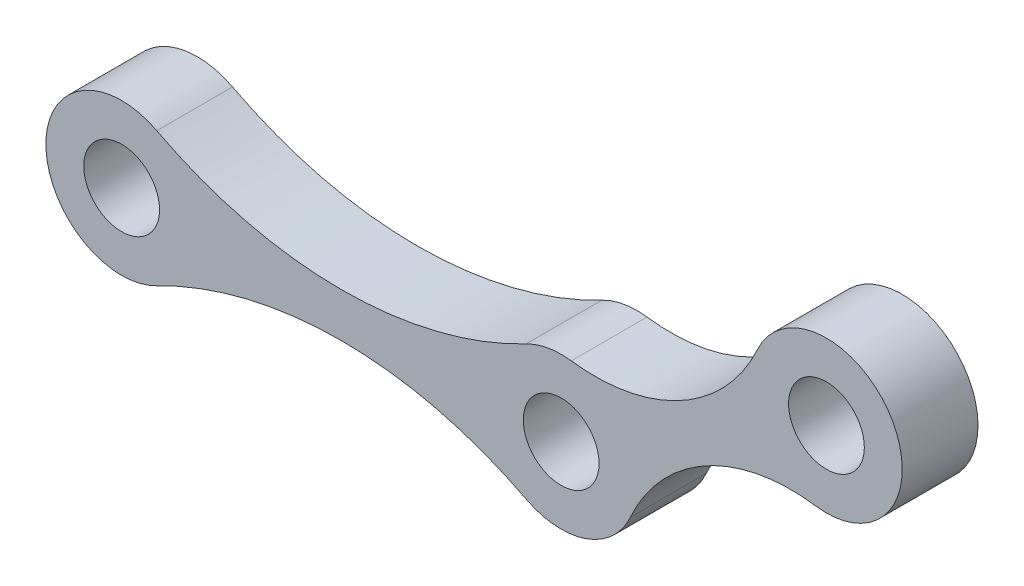
ISO-10303-21;
HEADER;
FILE_DESCRIPTION(('STEP AP214'),'2;1');
FILE_NAME('part.step','',(''),(''),'','','');
FILE_SCHEMA(('AUTOMOTIVE_DESIGN { 1 0 10303 214 1 1 1 1 }'));
ENDSEC;
DATA;
#1=APPLICATION_CONTEXT('core data for automotive mechanical design processes');
#2=APPLICATION_PROTOCOL_DEFINITION('international standard','automotive_design',2000,#1);
#3=PRODUCT_CONTEXT('',#1,'mechanical');
#4=PRODUCT('Part','Part','',(#3));
#5=PRODUCT_RELATED_PRODUCT_CATEGORY('part','',(#4));
#6=PRODUCT_DEFINITION_FORMATION('','',#4);
#7=PRODUCT_DEFINITION_CONTEXT('part definition',#1,'design');
#8=PRODUCT_DEFINITION('design','',#6,#7);
#9=PRODUCT_DEFINITION_SHAPE('','',#8);
#10=(LENGTH_UNIT() NAMED_UNIT(*) SI_UNIT(.MILLI.,.METRE.));
#11=(NAMED_UNIT(*) PLANE_ANGLE_UNIT() SI_UNIT($,.RADIAN.));
#12=(NAMED_UNIT(*) SI_UNIT($,.STERADIAN.) SOLID_ANGLE_UNIT());
#13=UNCERTAINTY_MEASURE_WITH_UNIT(LENGTH_MEASURE(1.E-05),#10,'distance_accuracy_value','');
#14=(GEOMETRIC_REPRESENTATION_CONTEXT(3) GLOBAL_UNCERTAINTY_ASSIGNED_CONTEXT((#13)) GLOBAL_UNIT_ASSIGNED_CONTEXT((#10,
#11,#12)) REPRESENTATION_CONTEXT('',''));
#15=CARTESIAN_POINT('',(0.,0.,0.));
#16=DIRECTION('',(0.,0.,1.));
#17=DIRECTION('',(1.,0.,0.));
#18=AXIS2_PLACEMENT_3D('',#15,#16,#17);
#19=CARTESIAN_POINT('',(46.5043103448276,9.67466378495718,2.5));
#20=DIRECTION('',(0.,0.,1.));
#21=DIRECTION('',(1.,0.,0.));
#22=AXIS2_PLACEMENT_3D('',#19,#20,#21);
#23=PLANE('',#22);
#24=CARTESIAN_POINT('',(29.,0.,2.5));
#25=DIRECTION('',(0.,0.,1.));
#26=DIRECTION('',(1.,0.,0.));
#27=AXIS2_PLACEMENT_3D('',#24,#25,#26);
#28=CIRCLE('',#27,2.5);
#29=CARTESIAN_POINT('',(31.5,0.,2.5));
#30=VERTEX_POINT('',#29);
#31=EDGE_CURVE('E166',#30,#30,#28,.T.);
#32=ORIENTED_EDGE('',*,*,#31,.F.);
#33=EDGE_LOOP('',(#32));
#34=FACE_BOUND('',#33,.T.);
#35=CARTESIAN_POINT('',(46.5043103448276,9.67466378495718,2.5));
#36=DIRECTION('',(0.,0.,1.));
#37=DIRECTION('',(1.,0.,0.));
#38=AXIS2_PLACEMENT_3D('',#35,#36,#37);
#39=CIRCLE('',#38,2.5);
#40=CARTESIAN_POINT('',(49.0043103448276,9.67466378495718,2.5));
#41=VERTEX_POINT('',#40);
#42=EDGE_CURVE('E106',#41,#41,#39,.T.);
#43=ORIENTED_EDGE('',*,*,#42,.F.);
#44=EDGE_LOOP('',(#43));
#45=FACE_BOUND('',#44,.T.);
#46=CARTESIAN_POINT('',(0.,0.,2.5));
#47=DIRECTION('',(0.,0.,1.));
#48=DIRECTION('',(1.,0.,0.));
#49=AXIS2_PLACEMENT_3D('',#46,#47,#48);
#50=CIRCLE('',#49,2.5);
#51=CARTESIAN_POINT('',(2.5,0.,2.5));
#52=VERTEX_POINT('',#51);
#53=EDGE_CURVE('E160',#52,#52,#50,.T.);
#54=ORIENTED_EDGE('',*,*,#53,.F.);
#55=EDGE_LOOP('',(#54));
#56=FACE_BOUND('',#55,.T.);
#57=CARTESIAN_POINT('',(14.5,-28.0695342802877,2.5));
#58=DIRECTION('',(0.,0.,-1.));
#59=DIRECTION('',(1.,0.,0.));
#60=AXIS2_PLACEMENT_3D('',#57,#58,#59);
#61=CIRCLE('',#60,26.593492284207);
#62=CARTESIAN_POINT('',(2.2947763845734,-4.44229685464674,2.5));
#63=VERTEX_POINT('',#62);
#64=CARTESIAN_POINT('',(26.7052236154266,-4.44229685464674,2.5));
#65=VERTEX_POINT('',#64);
#66=EDGE_CURVE('E119',#63,#65,#61,.T.);
#67=ORIENTED_EDGE('',*,*,#66,.T.);
#68=CARTESIAN_POINT('',(29.,0.,2.5));
#69=DIRECTION('',(0.,0.,1.));
#70=DIRECTION('',(1.,0.,0.));
#71=AXIS2_PLACEMENT_3D('',#68,#69,#70);
#72=CIRCLE('',#71,5.);
#73=CARTESIAN_POINT('',(33.5688991211203,-2.03104919217295,2.5));
#74=VERTEX_POINT('',#73);
#75=EDGE_CURVE('E12',#65,#74,#72,.T.);
#76=ORIENTED_EDGE('',*,*,#75,.T.);
#77=CARTESIAN_POINT('',(44.1474358599628,-6.73361055941316,2.5));
#78=DIRECTION('',(0.,0.,-1.));
#79=DIRECTION('',(1.,0.,0.));
#80=AXIS2_PLACEMENT_3D('',#77,#78,#79);
#81=CIRCLE('',#80,11.5766801349826);
#82=CARTESIAN_POINT('',(45.7934097104204,4.72545977946301,2.5));
#83=VERTEX_POINT('',#82);
#84=EDGE_CURVE('E134',#74,#83,#81,.T.);
#85=ORIENTED_EDGE('',*,*,#84,.T.);
#86=CARTESIAN_POINT('',(46.5043103448276,9.67466378495718,2.5));
#87=DIRECTION('',(0.,0.,1.));
#88=DIRECTION('',(1.,0.,0.));
#89=AXIS2_PLACEMENT_3D('',#86,#87,#88);
#90=CIRCLE('',#89,5.00000000000001);
#91=CARTESIAN_POINT('',(41.9532372313997,11.7453480960568,2.5));
#92=VERTEX_POINT('',#91);
#93=EDGE_CURVE('E56',#83,#92,#90,.T.);
#94=ORIENTED_EDGE('',*,*,#93,.T.);
#95=CARTESIAN_POINT('',(31.2399930695595,16.6197471782095,2.5));
#96=DIRECTION('',(0.,0.,-1.));
#97=DIRECTION('',(-1.,0.,0.));
#98=AXIS2_PLACEMENT_3D('',#95,#96,#97);
#99=CIRCLE('',#98,11.7700198335982);
#100=CARTESIAN_POINT('',(29.6678564163269,4.95519604124509,2.5));
#101=VERTEX_POINT('',#100);
#102=EDGE_CURVE('E136',#92,#101,#99,.T.);
#103=ORIENTED_EDGE('',*,*,#102,.T.);
#104=CARTESIAN_POINT('',(29.,0.,2.5));
#105=DIRECTION('',(0.,0.,1.));
#106=DIRECTION('',(1.,0.,0.));
#107=AXIS2_PLACEMENT_3D('',#104,#105,#106);
#108=CIRCLE('',#107,5.);
#109=CARTESIAN_POINT('',(26.6829189594039,4.43070371964886,2.5));
#110=VERTEX_POINT('',#109);
#111=EDGE_CURVE('E139',#101,#110,#108,.T.);
#112=ORIENTED_EDGE('',*,*,#111,.T.);
#113=CARTESIAN_POINT('',(14.5,27.7267833145711,2.5));
#114=DIRECTION('',(0.,0.,-1.));
#115=DIRECTION('',(-1.,0.,0.));
#116=AXIS2_PLACEMENT_3D('',#113,#114,#115);
#117=CIRCLE('',#116,26.2893674108822);
#118=CARTESIAN_POINT('',(2.31708104059608,4.43070371964886,2.5));
#119=VERTEX_POINT('',#118);
#120=EDGE_CURVE('E124',#110,#119,#117,.T.);
#121=ORIENTED_EDGE('',*,*,#120,.T.);
#122=CARTESIAN_POINT('',(0.,0.,2.5));
#123=DIRECTION('',(0.,0.,1.));
#124=DIRECTION('',(1.,0.,0.));
#125=AXIS2_PLACEMENT_3D('',#122,#123,#124);
#126=CIRCLE('',#125,5.);
#127=EDGE_CURVE('E43',#119,#63,#126,.T.);
#128=ORIENTED_EDGE('',*,*,#127,.T.);
#129=EDGE_LOOP('',(#67,#76,#85,#94,#103,#112,#121,#128));
#130=FACE_BOUND('',#129,.T.);
#131=ADVANCED_FACE('F34',(#34,#45,#56,#130),#23,.T.);
#132=CARTESIAN_POINT('',(46.5043103448276,9.67466378495718,-2.5));
#133=DIRECTION('',(0.,0.,1.));
#134=DIRECTION('',(1.,0.,0.));
#135=AXIS2_PLACEMENT_3D('',#132,#133,#134);
#136=PLANE('',#135);
#137=CARTESIAN_POINT('',(0.,0.,-2.5));
#138=DIRECTION('',(0.,0.,1.));
#139=DIRECTION('',(1.,0.,0.));
#140=AXIS2_PLACEMENT_3D('',#137,#138,#139);
#141=CIRCLE('',#140,2.5);
#142=CARTESIAN_POINT('',(2.5,0.,-2.5));
#143=VERTEX_POINT('',#142);
#144=EDGE_CURVE('E145',#143,#143,#141,.T.);
#145=ORIENTED_EDGE('',*,*,#144,.T.);
#146=EDGE_LOOP('',(#145));
#147=FACE_BOUND('',#146,.T.);
#148=CARTESIAN_POINT('',(29.,0.,-2.5));
#149=DIRECTION('',(0.,0.,1.));
#150=DIRECTION('',(1.,0.,0.));
#151=AXIS2_PLACEMENT_3D('',#148,#149,#150);
#152=CIRCLE('',#151,2.5);
#153=CARTESIAN_POINT('',(31.5,0.,-2.5));
#154=VERTEX_POINT('',#153);
#155=EDGE_CURVE('E163',#154,#154,#152,.T.);
#156=ORIENTED_EDGE('',*,*,#155,.T.);
#157=EDGE_LOOP('',(#156));
#158=FACE_BOUND('',#157,.T.);
#159=CARTESIAN_POINT('',(46.5043103448276,9.67466378495718,-2.5));
#160=DIRECTION('',(0.,0.,1.));
#161=DIRECTION('',(1.,0.,0.));
#162=AXIS2_PLACEMENT_3D('',#159,#160,#161);
#163=CIRCLE('',#162,2.5);
#164=CARTESIAN_POINT('',(49.0043103448276,9.67466378495718,-2.5));
#165=VERTEX_POINT('',#164);
#166=EDGE_CURVE('E169',#165,#165,#163,.T.);
#167=ORIENTED_EDGE('',*,*,#166,.T.);
#168=EDGE_LOOP('',(#167));
#169=FACE_BOUND('',#168,.T.);
#170=CARTESIAN_POINT('',(29.,0.,-2.5));
#171=DIRECTION('',(0.,0.,1.));
#172=DIRECTION('',(1.,0.,0.));
#173=AXIS2_PLACEMENT_3D('',#170,#171,#172);
#174=CIRCLE('',#173,5.);
#175=CARTESIAN_POINT('',(26.7052236154266,-4.44229685464674,-2.5));
#176=VERTEX_POINT('',#175);
#177=CARTESIAN_POINT('',(33.5688991211203,-2.03104919217295,-2.5));
#178=VERTEX_POINT('',#177);
#179=EDGE_CURVE('E38',#176,#178,#174,.T.);
#180=ORIENTED_EDGE('',*,*,#179,.F.);
#181=CARTESIAN_POINT('',(14.5,-28.0695342802877,-2.5));
#182=DIRECTION('',(0.,0.,-1.));
#183=DIRECTION('',(1.,0.,0.));
#184=AXIS2_PLACEMENT_3D('',#181,#182,#183);
#185=CIRCLE('',#184,26.593492284207);
#186=CARTESIAN_POINT('',(2.2947763845734,-4.44229685464674,-2.5));
#187=VERTEX_POINT('',#186);
#188=EDGE_CURVE('E113',#187,#176,#185,.T.);
#189=ORIENTED_EDGE('',*,*,#188,.F.);
#190=CARTESIAN_POINT('',(0.,0.,-2.5));
#191=DIRECTION('',(0.,0.,1.));
#192=DIRECTION('',(1.,0.,0.));
#193=AXIS2_PLACEMENT_3D('',#190,#191,#192);
#194=CIRCLE('',#193,5.);
#195=CARTESIAN_POINT('',(2.31708104059608,4.43070371964886,-2.5));
#196=VERTEX_POINT('',#195);
#197=EDGE_CURVE('E105',#196,#187,#194,.T.);
#198=ORIENTED_EDGE('',*,*,#197,.F.);
#199=CARTESIAN_POINT('',(14.5,27.7267833145711,-2.5));
#200=DIRECTION('',(0.,0.,-1.));
#201=DIRECTION('',(-1.,0.,0.));
#202=AXIS2_PLACEMENT_3D('',#199,#200,#201);
#203=CIRCLE('',#202,26.2893674108822);
#204=CARTESIAN_POINT('',(26.6829189594039,4.43070371964886,-2.5));
#205=VERTEX_POINT('',#204);
#206=EDGE_CURVE('E129',#205,#196,#203,.T.);
#207=ORIENTED_EDGE('',*,*,#206,.F.);
#208=CARTESIAN_POINT('',(29.,0.,-2.5));
#209=DIRECTION('',(0.,0.,1.));
#210=DIRECTION('',(1.,0.,0.));
#211=AXIS2_PLACEMENT_3D('',#208,#209,#210);
#212=CIRCLE('',#211,5.);
#213=CARTESIAN_POINT('',(29.6678564163269,4.95519604124509,-2.5));
#214=VERTEX_POINT('',#213);
#215=EDGE_CURVE('E121',#214,#205,#212,.T.);
#216=ORIENTED_EDGE('',*,*,#215,.F.);
#217=CARTESIAN_POINT('',(31.2399930695595,16.6197471782095,-2.5));
#218=DIRECTION('',(0.,0.,-1.));
#219=DIRECTION('',(-1.,0.,0.));
#220=AXIS2_PLACEMENT_3D('',#217,#218,#219);
#221=CIRCLE('',#220,11.7700198335982);
#222=CARTESIAN_POINT('',(41.9532372313997,11.7453480960568,-2.5));
#223=VERTEX_POINT('',#222);
#224=EDGE_CURVE('E104',#223,#214,#221,.T.);
#225=ORIENTED_EDGE('',*,*,#224,.F.);
#226=CARTESIAN_POINT('',(46.5043103448276,9.67466378495718,-2.5));
#227=DIRECTION('',(0.,0.,1.));
#228=DIRECTION('',(1.,0.,0.));
#229=AXIS2_PLACEMENT_3D('',#226,#227,#228);
#230=CIRCLE('',#229,5.00000000000001);
#231=CARTESIAN_POINT('',(45.7934097104204,4.72545977946301,-2.5));
#232=VERTEX_POINT('',#231);
#233=EDGE_CURVE('E51',#232,#223,#230,.T.);
#234=ORIENTED_EDGE('',*,*,#233,.F.);
#235=CARTESIAN_POINT('',(44.1474358599628,-6.73361055941316,-2.5));
#236=DIRECTION('',(0.,0.,-1.));
#237=DIRECTION('',(1.,0.,0.));
#238=AXIS2_PLACEMENT_3D('',#235,#236,#237);
#239=CIRCLE('',#238,11.5766801349826);
#240=EDGE_CURVE('E101',#178,#232,#239,.T.);
#241=ORIENTED_EDGE('',*,*,#240,.F.);
#242=EDGE_LOOP('',(#180,#189,#198,#207,#216,#225,#234,#241));
#243=FACE_BOUND('',#242,.T.);
#244=ADVANCED_FACE('F99',(#147,#158,#169,#243),#136,.F.);
#245=CARTESIAN_POINT('',(46.5043103448276,9.67466378495718,2.5));
#246=DIRECTION('',(0.,0.,-1.));
#247=DIRECTION('',(-1.,0.,0.));
#248=AXIS2_PLACEMENT_3D('',#245,#246,#247);
#249=CYLINDRICAL_SURFACE('',#248,5.00000000000001);
#250=ORIENTED_EDGE('',*,*,#233,.T.);
#251=DIRECTION('',(0.,0.,1.));
#252=VECTOR('',#251,1.);
#253=CARTESIAN_POINT('',(41.9532372313997,11.7453480960568,-2.5));
#254=LINE('',#253,#252);
#255=EDGE_CURVE('E112',#223,#92,#254,.T.);
#256=ORIENTED_EDGE('',*,*,#255,.T.);
#257=ORIENTED_EDGE('',*,*,#93,.F.);
#258=DIRECTION('',(0.,0.,1.));
#259=VECTOR('',#258,1.);
#260=CARTESIAN_POINT('',(45.7934097104204,4.72545977946301,-2.5));
#261=LINE('',#260,#259);
#262=EDGE_CURVE('E108',#232,#83,#261,.T.);
#263=ORIENTED_EDGE('',*,*,#262,.F.);
#264=EDGE_LOOP('',(#250,#256,#257,#263));
#265=FACE_BOUND('',#264,.T.);
#266=ADVANCED_FACE('F36',(#265),#249,.T.);
#267=CARTESIAN_POINT('',(0.,0.,2.5));
#268=DIRECTION('',(0.,0.,-1.));
#269=DIRECTION('',(-1.,0.,0.));
#270=AXIS2_PLACEMENT_3D('',#267,#268,#269);
#271=CYLINDRICAL_SURFACE('',#270,5.);
#272=ORIENTED_EDGE('',*,*,#197,.T.);
#273=DIRECTION('',(0.,0.,1.));
#274=VECTOR('',#273,1.);
#275=CARTESIAN_POINT('',(2.2947763845734,-4.44229685464674,-2.5));
#276=LINE('',#275,#274);
#277=EDGE_CURVE('E149',#187,#63,#276,.T.);
#278=ORIENTED_EDGE('',*,*,#277,.T.);
#279=ORIENTED_EDGE('',*,*,#127,.F.);
#280=DIRECTION('',(0.,0.,1.));
#281=VECTOR('',#280,1.);
#282=CARTESIAN_POINT('',(2.31708104059608,4.43070371964886,-2.5));
#283=LINE('',#282,#281);
#284=EDGE_CURVE('E152',#196,#119,#283,.T.);
#285=ORIENTED_EDGE('',*,*,#284,.F.);
#286=EDGE_LOOP('',(#272,#278,#279,#285));
#287=FACE_BOUND('',#286,.T.);
#288=ADVANCED_FACE('F188',(#287),#271,.T.);
#289=CARTESIAN_POINT('',(29.,0.,2.5));
#290=DIRECTION('',(0.,0.,-1.));
#291=DIRECTION('',(-1.,0.,0.));
#292=AXIS2_PLACEMENT_3D('',#289,#290,#291);
#293=CYLINDRICAL_SURFACE('',#292,5.);
#294=ORIENTED_EDGE('',*,*,#179,.T.);
#295=DIRECTION('',(0.,0.,1.));
#296=VECTOR('',#295,1.);
#297=CARTESIAN_POINT('',(33.5688991211203,-2.03104919217295,-2.5));
#298=LINE('',#297,#296);
#299=EDGE_CURVE('E118',#178,#74,#298,.T.);
#300=ORIENTED_EDGE('',*,*,#299,.T.);
#301=ORIENTED_EDGE('',*,*,#75,.F.);
#302=DIRECTION('',(0.,0.,1.));
#303=VECTOR('',#302,1.);
#304=CARTESIAN_POINT('',(26.7052236154266,-4.44229685464674,-2.5));
#305=LINE('',#304,#303);
#306=EDGE_CURVE('E146',#176,#65,#305,.T.);
#307=ORIENTED_EDGE('',*,*,#306,.F.);
#308=EDGE_LOOP('',(#294,#300,#301,#307));
#309=FACE_BOUND('',#308,.T.);
#310=ADVANCED_FACE('F182',(#309),#293,.T.);
#311=CARTESIAN_POINT('',(46.5043103448276,9.67466378495718,2.5));
#312=DIRECTION('',(0.,0.,-1.));
#313=DIRECTION('',(-1.,0.,0.));
#314=AXIS2_PLACEMENT_3D('',#311,#312,#313);
#315=CYLINDRICAL_SURFACE('',#314,2.5);
#316=ORIENTED_EDGE('',*,*,#42,.T.);
#317=EDGE_LOOP('',(#316));
#318=FACE_BOUND('',#317,.T.);
#319=ORIENTED_EDGE('',*,*,#166,.F.);
#320=EDGE_LOOP('',(#319));
#321=FACE_BOUND('',#320,.T.);
#322=ADVANCED_FACE('F218',(#318,#321),#315,.F.);
#323=CARTESIAN_POINT('',(29.,0.,2.5));
#324=DIRECTION('',(0.,0.,-1.));
#325=DIRECTION('',(-1.,0.,0.));
#326=AXIS2_PLACEMENT_3D('',#323,#324,#325);
#327=CYLINDRICAL_SURFACE('',#326,2.5);
#328=ORIENTED_EDGE('',*,*,#31,.T.);
#329=EDGE_LOOP('',(#328));
#330=FACE_BOUND('',#329,.T.);
#331=ORIENTED_EDGE('',*,*,#155,.F.);
#332=EDGE_LOOP('',(#331));
#333=FACE_BOUND('',#332,.T.);
#334=ADVANCED_FACE('F244',(#330,#333),#327,.F.);
#335=CARTESIAN_POINT('',(0.,0.,2.5));
#336=DIRECTION('',(0.,0.,-1.));
#337=DIRECTION('',(-1.,0.,0.));
#338=AXIS2_PLACEMENT_3D('',#335,#336,#337);
#339=CYLINDRICAL_SURFACE('',#338,2.5);
#340=ORIENTED_EDGE('',*,*,#53,.T.);
#341=EDGE_LOOP('',(#340));
#342=FACE_BOUND('',#341,.T.);
#343=ORIENTED_EDGE('',*,*,#144,.F.);
#344=EDGE_LOOP('',(#343));
#345=FACE_BOUND('',#344,.T.);
#346=ADVANCED_FACE('F241',(#342,#345),#339,.F.);
#347=CARTESIAN_POINT('',(44.1474358599628,-6.73361055941316,-2.5));
#348=DIRECTION('',(0.,0.,1.));
#349=DIRECTION('',(1.,0.,0.));
#350=AXIS2_PLACEMENT_3D('',#347,#348,#349);
#351=CYLINDRICAL_SURFACE('',#350,11.5766801349826);
#352=ORIENTED_EDGE('',*,*,#84,.F.);
#353=ORIENTED_EDGE('',*,*,#299,.F.);
#354=ORIENTED_EDGE('',*,*,#240,.T.);
#355=ORIENTED_EDGE('',*,*,#262,.T.);
#356=EDGE_LOOP('',(#352,#353,#354,#355));
#357=FACE_BOUND('',#356,.T.);
#358=ADVANCED_FACE('F116',(#357),#351,.F.);
#359=CARTESIAN_POINT('',(14.5,-28.0695342802877,-2.5));
#360=DIRECTION('',(0.,0.,1.));
#361=DIRECTION('',(1.,0.,0.));
#362=AXIS2_PLACEMENT_3D('',#359,#360,#361);
#363=CYLINDRICAL_SURFACE('',#362,26.593492284207);
#364=ORIENTED_EDGE('',*,*,#66,.F.);
#365=ORIENTED_EDGE('',*,*,#277,.F.);
#366=ORIENTED_EDGE('',*,*,#188,.T.);
#367=ORIENTED_EDGE('',*,*,#306,.T.);
#368=EDGE_LOOP('',(#364,#365,#366,#367));
#369=FACE_BOUND('',#368,.T.);
#370=ADVANCED_FACE('F187',(#369),#363,.F.);
#371=CARTESIAN_POINT('',(14.5,27.7267833145711,-2.5));
#372=DIRECTION('',(0.,0.,1.));
#373=DIRECTION('',(1.,0.,0.));
#374=AXIS2_PLACEMENT_3D('',#371,#372,#373);
#375=CYLINDRICAL_SURFACE('',#374,26.2893674108822);
#376=ORIENTED_EDGE('',*,*,#120,.F.);
#377=DIRECTION('',(0.,0.,1.));
#378=VECTOR('',#377,1.);
#379=CARTESIAN_POINT('',(26.6829189594039,4.43070371964886,-2.5));
#380=LINE('',#379,#378);
#381=EDGE_CURVE('E155',#205,#110,#380,.T.);
#382=ORIENTED_EDGE('',*,*,#381,.F.);
#383=ORIENTED_EDGE('',*,*,#206,.T.);
#384=ORIENTED_EDGE('',*,*,#284,.T.);
#385=EDGE_LOOP('',(#376,#382,#383,#384));
#386=FACE_BOUND('',#385,.T.);
#387=ADVANCED_FACE('F192',(#386),#375,.F.);
#388=CARTESIAN_POINT('',(29.,0.,-2.5));
#389=DIRECTION('',(0.,0.,1.));
#390=DIRECTION('',(1.,0.,0.));
#391=AXIS2_PLACEMENT_3D('',#388,#389,#390);
#392=CYLINDRICAL_SURFACE('',#391,5.);
#393=ORIENTED_EDGE('',*,*,#111,.F.);
#394=DIRECTION('',(0.,0.,1.));
#395=VECTOR('',#394,1.);
#396=CARTESIAN_POINT('',(29.6678564163269,4.95519604124509,-2.5));
#397=LINE('',#396,#395);
#398=EDGE_CURVE('E157',#214,#101,#397,.T.);
#399=ORIENTED_EDGE('',*,*,#398,.F.);
#400=ORIENTED_EDGE('',*,*,#215,.T.);
#401=ORIENTED_EDGE('',*,*,#381,.T.);
#402=EDGE_LOOP('',(#393,#399,#400,#401));
#403=FACE_BOUND('',#402,.T.);
#404=ADVANCED_FACE('F196',(#403),#392,.T.);
#405=CARTESIAN_POINT('',(31.2399930695595,16.6197471782095,-2.5));
#406=DIRECTION('',(0.,0.,1.));
#407=DIRECTION('',(1.,0.,0.));
#408=AXIS2_PLACEMENT_3D('',#405,#406,#407);
#409=CYLINDRICAL_SURFACE('',#408,11.7700198335982);
#410=ORIENTED_EDGE('',*,*,#102,.F.);
#411=ORIENTED_EDGE('',*,*,#255,.F.);
#412=ORIENTED_EDGE('',*,*,#224,.T.);
#413=ORIENTED_EDGE('',*,*,#398,.T.);
#414=EDGE_LOOP('',(#410,#411,#412,#413));
#415=FACE_BOUND('',#414,.T.);
#416=ADVANCED_FACE('F198',(#415),#409,.F.);
#417=CLOSED_SHELL('',(#131,#244,#266,#288,#310,#322,#334,#346,#358,#370,#387,#404,#416));
#418=MANIFOLD_SOLID_BREP('B2',#417);
#419=ADVANCED_BREP_SHAPE_REPRESENTATION('',(#18,#418),#14);
#420=SHAPE_DEFINITION_REPRESENTATION(#9,#419);
ENDSEC;
END-ISO-10303-21;
